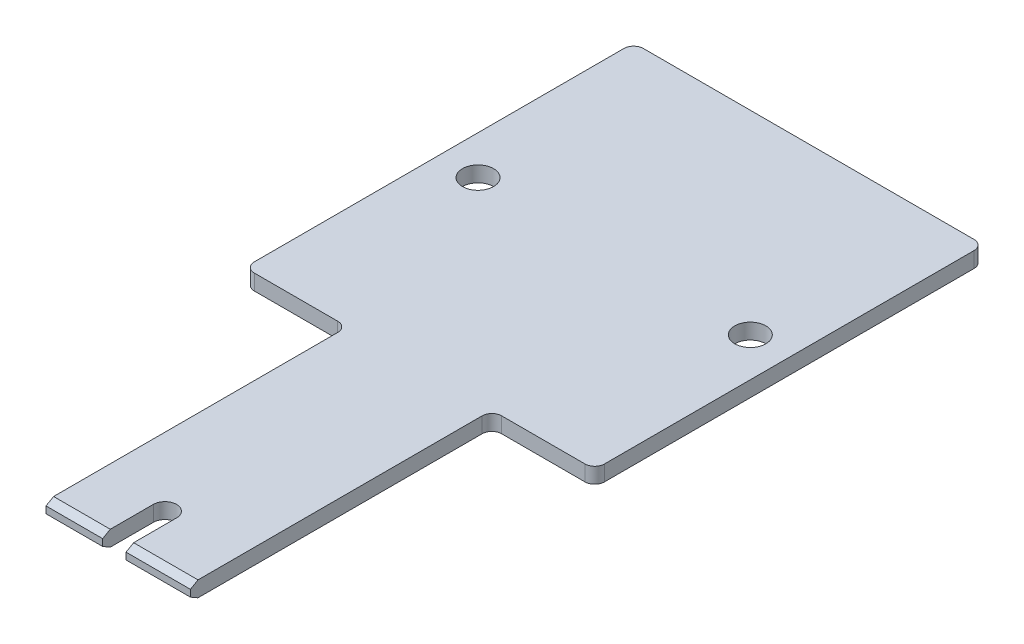
ISO-10303-21;
HEADER;
FILE_DESCRIPTION(('STEP AP214'),'2;1');
FILE_NAME('part.step','',(''),(''),'','','');
FILE_SCHEMA(('AUTOMOTIVE_DESIGN { 1 0 10303 214 1 1 1 1 }'));
ENDSEC;
DATA;
#1=APPLICATION_CONTEXT('core data for automotive mechanical design processes');
#2=APPLICATION_PROTOCOL_DEFINITION('international standard','automotive_design',2000,#1);
#3=PRODUCT_CONTEXT('',#1,'mechanical');
#4=PRODUCT('Part','Part','',(#3));
#5=PRODUCT_RELATED_PRODUCT_CATEGORY('part','',(#4));
#6=PRODUCT_DEFINITION_FORMATION('','',#4);
#7=PRODUCT_DEFINITION_CONTEXT('part definition',#1,'design');
#8=PRODUCT_DEFINITION('design','',#6,#7);
#9=PRODUCT_DEFINITION_SHAPE('','',#8);
#10=(LENGTH_UNIT() NAMED_UNIT(*) SI_UNIT(.MILLI.,.METRE.));
#11=(NAMED_UNIT(*) PLANE_ANGLE_UNIT() SI_UNIT($,.RADIAN.));
#12=(NAMED_UNIT(*) SI_UNIT($,.STERADIAN.) SOLID_ANGLE_UNIT());
#13=UNCERTAINTY_MEASURE_WITH_UNIT(LENGTH_MEASURE(1.E-05),#10,'distance_accuracy_value','');
#14=(GEOMETRIC_REPRESENTATION_CONTEXT(3) GLOBAL_UNCERTAINTY_ASSIGNED_CONTEXT((#13)) GLOBAL_UNIT_ASSIGNED_CONTEXT((#10,
#11,#12)) REPRESENTATION_CONTEXT('',''));
#15=CARTESIAN_POINT('',(0.,0.,0.));
#16=DIRECTION('',(0.,0.,1.));
#17=DIRECTION('',(1.,0.,0.));
#18=AXIS2_PLACEMENT_3D('',#15,#16,#17);
#19=CARTESIAN_POINT('',(-7.425,1.6,15.5));
#20=DIRECTION('',(0.,0.,-1.));
#21=DIRECTION('',(-1.,0.,0.));
#22=AXIS2_PLACEMENT_3D('',#19,#20,#21);
#23=PLANE('',#22);
#24=DIRECTION('',(-1.,0.,0.));
#25=VECTOR('',#24,1.);
#26=CARTESIAN_POINT('',(-7.425,1.15,15.5));
#27=LINE('',#26,#25);
#28=CARTESIAN_POINT('',(7.425,1.15,15.5));
#29=VERTEX_POINT('',#28);
#30=CARTESIAN_POINT('',(0.804999999999998,1.15,15.5));
#31=VERTEX_POINT('',#30);
#32=EDGE_CURVE('E278',#29,#31,#27,.T.);
#33=ORIENTED_EDGE('',*,*,#32,.T.);
#34=DIRECTION('',(0.,1.,0.));
#35=VECTOR('',#34,1.);
#36=CARTESIAN_POINT('',(0.804999999999998,0.,15.5));
#37=LINE('',#36,#35);
#38=CARTESIAN_POINT('',(0.804999999999998,0.449999999999999,15.5));
#39=VERTEX_POINT('',#38);
#40=EDGE_CURVE('E222',#39,#31,#37,.T.);
#41=ORIENTED_EDGE('',*,*,#40,.F.);
#42=DIRECTION('',(1.,0.,0.));
#43=VECTOR('',#42,1.);
#44=CARTESIAN_POINT('',(-7.425,0.449999999999999,15.5));
#45=LINE('',#44,#43);
#46=CARTESIAN_POINT('',(7.425,0.449999999999999,15.5));
#47=VERTEX_POINT('',#46);
#48=EDGE_CURVE('E281',#39,#47,#45,.T.);
#49=ORIENTED_EDGE('',*,*,#48,.T.);
#50=DIRECTION('',(0.,-1.,0.));
#51=VECTOR('',#50,1.);
#52=CARTESIAN_POINT('',(7.425,1.6,15.5));
#53=LINE('',#52,#51);
#54=EDGE_CURVE('E253',#29,#47,#53,.T.);
#55=ORIENTED_EDGE('',*,*,#54,.F.);
#56=EDGE_LOOP('',(#33,#41,#49,#55));
#57=FACE_BOUND('',#56,.T.);
#58=ADVANCED_FACE('F37',(#57),#23,.F.);
#59=CARTESIAN_POINT('',(-7.425,0.449999999999999,15.5));
#60=DIRECTION('',(0.,0.866025403784441,-0.499999999999996));
#61=DIRECTION('',(1.,0.,0.));
#62=AXIS2_PLACEMENT_3D('',#59,#60,#61);
#63=PLANE('',#62);
#64=DIRECTION('',(0.,-0.499999999999996,-0.866025403784441));
#65=VECTOR('',#64,1.);
#66=CARTESIAN_POINT('',(0.804999999999998,0.449999999999998,15.5));
#67=LINE('',#66,#65);
#68=CARTESIAN_POINT('',(0.804999999999998,0.,14.720577136594));
#69=VERTEX_POINT('',#68);
#70=EDGE_CURVE('E230',#69,#39,#67,.F.);
#71=ORIENTED_EDGE('',*,*,#70,.F.);
#72=DIRECTION('',(-1.,0.,0.));
#73=VECTOR('',#72,1.);
#74=CARTESIAN_POINT('',(0.,0.,14.720577136594));
#75=LINE('',#74,#73);
#76=CARTESIAN_POINT('',(7.425,0.,14.720577136594));
#77=VERTEX_POINT('',#76);
#78=EDGE_CURVE('E211',#77,#69,#75,.T.);
#79=ORIENTED_EDGE('',*,*,#78,.F.);
#80=DIRECTION('',(0.,0.499999999999996,0.866025403784441));
#81=VECTOR('',#80,1.);
#82=CARTESIAN_POINT('',(7.425,0.449999999999998,15.5));
#83=LINE('',#82,#81);
#84=EDGE_CURVE('E287',#47,#77,#83,.F.);
#85=ORIENTED_EDGE('',*,*,#84,.F.);
#86=ORIENTED_EDGE('',*,*,#48,.F.);
#87=EDGE_LOOP('',(#71,#79,#85,#86));
#88=FACE_BOUND('',#87,.T.);
#89=ADVANCED_FACE('F424',(#88),#63,.F.);
#90=CARTESIAN_POINT('',(0.,1.6,14.720577136594));
#91=DIRECTION('',(0.,0.866025403784441,0.499999999999996));
#92=DIRECTION('',(-1.,0.,0.));
#93=AXIS2_PLACEMENT_3D('',#90,#91,#92);
#94=PLANE('',#93);
#95=DIRECTION('',(0.,0.499999999999996,-0.866025403784441));
#96=VECTOR('',#95,1.);
#97=CARTESIAN_POINT('',(0.804999999999998,1.6,14.720577136594));
#98=LINE('',#97,#96);
#99=CARTESIAN_POINT('',(0.804999999999998,1.6,14.720577136594));
#100=VERTEX_POINT('',#99);
#101=EDGE_CURVE('E11',#31,#100,#98,.T.);
#102=ORIENTED_EDGE('',*,*,#101,.F.);
#103=ORIENTED_EDGE('',*,*,#32,.F.);
#104=DIRECTION('',(0.,-0.499999999999996,0.866025403784441));
#105=VECTOR('',#104,1.);
#106=CARTESIAN_POINT('',(7.425,1.6,14.720577136594));
#107=LINE('',#106,#105);
#108=CARTESIAN_POINT('',(7.425,1.6,14.720577136594));
#109=VERTEX_POINT('',#108);
#110=EDGE_CURVE('E285',#109,#29,#107,.T.);
#111=ORIENTED_EDGE('',*,*,#110,.F.);
#112=DIRECTION('',(1.,0.,0.));
#113=VECTOR('',#112,1.);
#114=CARTESIAN_POINT('',(7.425,1.6,14.720577136594));
#115=LINE('',#114,#113);
#116=EDGE_CURVE('E296',#100,#109,#115,.T.);
#117=ORIENTED_EDGE('',*,*,#116,.F.);
#118=EDGE_LOOP('',(#102,#103,#111,#117));
#119=FACE_BOUND('',#118,.T.);
#120=ADVANCED_FACE('F431',(#119),#94,.T.);
#121=CARTESIAN_POINT('',(7.425,1.6,-15.5));
#122=DIRECTION('',(-1.,0.,0.));
#123=DIRECTION('',(0.,0.,1.));
#124=AXIS2_PLACEMENT_3D('',#121,#122,#123);
#125=PLANE('',#124);
#126=DIRECTION('',(0.,0.,-1.));
#127=VECTOR('',#126,1.);
#128=CARTESIAN_POINT('',(7.425,0.,-15.5));
#129=LINE('',#128,#127);
#130=CARTESIAN_POINT('',(7.425,0.,-14.5));
#131=VERTEX_POINT('',#130);
#132=EDGE_CURVE('E232',#77,#131,#129,.T.);
#133=ORIENTED_EDGE('',*,*,#132,.T.);
#134=DIRECTION('',(0.,-1.,0.));
#135=VECTOR('',#134,1.);
#136=CARTESIAN_POINT('',(7.425,1.6,-14.5));
#137=LINE('',#136,#135);
#138=CARTESIAN_POINT('',(7.425,1.6,-14.5));
#139=VERTEX_POINT('',#138);
#140=EDGE_CURVE('E305',#131,#139,#137,.F.);
#141=ORIENTED_EDGE('',*,*,#140,.T.);
#142=DIRECTION('',(0.,0.,-1.));
#143=VECTOR('',#142,1.);
#144=CARTESIAN_POINT('',(7.425,1.6,-15.5));
#145=LINE('',#144,#143);
#146=EDGE_CURVE('E233',#109,#139,#145,.T.);
#147=ORIENTED_EDGE('',*,*,#146,.F.);
#148=ORIENTED_EDGE('',*,*,#110,.T.);
#149=ORIENTED_EDGE('',*,*,#54,.T.);
#150=ORIENTED_EDGE('',*,*,#84,.T.);
#151=EDGE_LOOP('',(#133,#141,#147,#148,#149,#150));
#152=FACE_BOUND('',#151,.T.);
#153=ADVANCED_FACE('F418',(#152),#125,.F.);
#154=CARTESIAN_POINT('',(18.,1.6,-15.5));
#155=DIRECTION('',(0.,0.,-1.));
#156=DIRECTION('',(-1.,0.,0.));
#157=AXIS2_PLACEMENT_3D('',#154,#155,#156);
#158=PLANE('',#157);
#159=DIRECTION('',(1.,0.,0.));
#160=VECTOR('',#159,1.);
#161=CARTESIAN_POINT('',(18.,1.6,-15.5));
#162=LINE('',#161,#160);
#163=CARTESIAN_POINT('',(8.425,1.6,-15.5));
#164=VERTEX_POINT('',#163);
#165=CARTESIAN_POINT('',(17.,1.6,-15.5));
#166=VERTEX_POINT('',#165);
#167=EDGE_CURVE('E236',#164,#166,#162,.T.);
#168=ORIENTED_EDGE('',*,*,#167,.F.);
#169=DIRECTION('',(0.,-1.,0.));
#170=VECTOR('',#169,1.);
#171=CARTESIAN_POINT('',(8.425,0.,-15.5));
#172=LINE('',#171,#170);
#173=CARTESIAN_POINT('',(8.425,0.,-15.5));
#174=VERTEX_POINT('',#173);
#175=EDGE_CURVE('E302',#164,#174,#172,.T.);
#176=ORIENTED_EDGE('',*,*,#175,.T.);
#177=DIRECTION('',(1.,0.,0.));
#178=VECTOR('',#177,1.);
#179=CARTESIAN_POINT('',(18.,0.,-15.5));
#180=LINE('',#179,#178);
#181=CARTESIAN_POINT('',(17.,0.,-15.5));
#182=VERTEX_POINT('',#181);
#183=EDGE_CURVE('E256',#174,#182,#180,.T.);
#184=ORIENTED_EDGE('',*,*,#183,.T.);
#185=DIRECTION('',(0.,-1.,0.));
#186=VECTOR('',#185,1.);
#187=CARTESIAN_POINT('',(17.,1.6,-15.5));
#188=LINE('',#187,#186);
#189=EDGE_CURVE('E300',#182,#166,#188,.F.);
#190=ORIENTED_EDGE('',*,*,#189,.T.);
#191=EDGE_LOOP('',(#168,#176,#184,#190));
#192=FACE_BOUND('',#191,.T.);
#193=ADVANCED_FACE('F411',(#192),#158,.F.);
#194=CARTESIAN_POINT('',(18.,1.6,-55.5));
#195=DIRECTION('',(-1.,0.,0.));
#196=DIRECTION('',(0.,0.,1.));
#197=AXIS2_PLACEMENT_3D('',#194,#195,#196);
#198=PLANE('',#197);
#199=DIRECTION('',(0.,0.,-1.));
#200=VECTOR('',#199,1.);
#201=CARTESIAN_POINT('',(18.,1.6,-55.5));
#202=LINE('',#201,#200);
#203=CARTESIAN_POINT('',(18.,1.6,-16.5));
#204=VERTEX_POINT('',#203);
#205=CARTESIAN_POINT('',(18.,1.6,-54.5));
#206=VERTEX_POINT('',#205);
#207=EDGE_CURVE('E240',#204,#206,#202,.T.);
#208=ORIENTED_EDGE('',*,*,#207,.F.);
#209=DIRECTION('',(0.,-1.,0.));
#210=VECTOR('',#209,1.);
#211=CARTESIAN_POINT('',(18.,1.6,-16.5));
#212=LINE('',#211,#210);
#213=CARTESIAN_POINT('',(18.,0.,-16.5));
#214=VERTEX_POINT('',#213);
#215=EDGE_CURVE('E309',#204,#214,#212,.T.);
#216=ORIENTED_EDGE('',*,*,#215,.T.);
#217=DIRECTION('',(0.,0.,-1.));
#218=VECTOR('',#217,1.);
#219=CARTESIAN_POINT('',(18.,0.,-55.5));
#220=LINE('',#219,#218);
#221=CARTESIAN_POINT('',(18.,0.,-54.5));
#222=VERTEX_POINT('',#221);
#223=EDGE_CURVE('E259',#214,#222,#220,.T.);
#224=ORIENTED_EDGE('',*,*,#223,.T.);
#225=DIRECTION('',(0.,-1.,0.));
#226=VECTOR('',#225,1.);
#227=CARTESIAN_POINT('',(18.,1.6,-54.5));
#228=LINE('',#227,#226);
#229=EDGE_CURVE('E307',#222,#206,#228,.F.);
#230=ORIENTED_EDGE('',*,*,#229,.T.);
#231=EDGE_LOOP('',(#208,#216,#224,#230));
#232=FACE_BOUND('',#231,.T.);
#233=ADVANCED_FACE('F402',(#232),#198,.F.);
#234=CARTESIAN_POINT('',(-18.,1.6,-55.5));
#235=DIRECTION('',(0.,0.,1.));
#236=DIRECTION('',(1.,0.,0.));
#237=AXIS2_PLACEMENT_3D('',#234,#235,#236);
#238=PLANE('',#237);
#239=DIRECTION('',(-1.,0.,0.));
#240=VECTOR('',#239,1.);
#241=CARTESIAN_POINT('',(-18.,1.6,-55.5));
#242=LINE('',#241,#240);
#243=CARTESIAN_POINT('',(17.,1.6,-55.5));
#244=VERTEX_POINT('',#243);
#245=CARTESIAN_POINT('',(-17.,1.6,-55.5));
#246=VERTEX_POINT('',#245);
#247=EDGE_CURVE('E243',#244,#246,#242,.T.);
#248=ORIENTED_EDGE('',*,*,#247,.F.);
#249=DIRECTION('',(0.,-1.,0.));
#250=VECTOR('',#249,1.);
#251=CARTESIAN_POINT('',(17.,1.6,-55.5));
#252=LINE('',#251,#250);
#253=CARTESIAN_POINT('',(17.,0.,-55.5));
#254=VERTEX_POINT('',#253);
#255=EDGE_CURVE('E330',#244,#254,#252,.T.);
#256=ORIENTED_EDGE('',*,*,#255,.T.);
#257=DIRECTION('',(-1.,0.,0.));
#258=VECTOR('',#257,1.);
#259=CARTESIAN_POINT('',(-18.,0.,-55.5));
#260=LINE('',#259,#258);
#261=CARTESIAN_POINT('',(-17.,0.,-55.5));
#262=VERTEX_POINT('',#261);
#263=EDGE_CURVE('E262',#254,#262,#260,.T.);
#264=ORIENTED_EDGE('',*,*,#263,.T.);
#265=DIRECTION('',(0.,-1.,0.));
#266=VECTOR('',#265,1.);
#267=CARTESIAN_POINT('',(-17.,1.6,-55.5));
#268=LINE('',#267,#266);
#269=EDGE_CURVE('E328',#262,#246,#268,.F.);
#270=ORIENTED_EDGE('',*,*,#269,.T.);
#271=EDGE_LOOP('',(#248,#256,#264,#270));
#272=FACE_BOUND('',#271,.T.);
#273=ADVANCED_FACE('F393',(#272),#238,.F.);
#274=CARTESIAN_POINT('',(-18.,1.6,-15.5));
#275=DIRECTION('',(1.,0.,0.));
#276=DIRECTION('',(0.,0.,-1.));
#277=AXIS2_PLACEMENT_3D('',#274,#275,#276);
#278=PLANE('',#277);
#279=DIRECTION('',(0.,0.,1.));
#280=VECTOR('',#279,1.);
#281=CARTESIAN_POINT('',(-18.,1.6,-15.5));
#282=LINE('',#281,#280);
#283=CARTESIAN_POINT('',(-18.,1.6,-54.5));
#284=VERTEX_POINT('',#283);
#285=CARTESIAN_POINT('',(-18.,1.6,-16.5));
#286=VERTEX_POINT('',#285);
#287=EDGE_CURVE('E246',#284,#286,#282,.T.);
#288=ORIENTED_EDGE('',*,*,#287,.F.);
#289=DIRECTION('',(0.,-1.,0.));
#290=VECTOR('',#289,1.);
#291=CARTESIAN_POINT('',(-18.,1.6,-54.5));
#292=LINE('',#291,#290);
#293=CARTESIAN_POINT('',(-18.,0.,-54.5));
#294=VERTEX_POINT('',#293);
#295=EDGE_CURVE('E335',#284,#294,#292,.T.);
#296=ORIENTED_EDGE('',*,*,#295,.T.);
#297=DIRECTION('',(0.,0.,1.));
#298=VECTOR('',#297,1.);
#299=CARTESIAN_POINT('',(-18.,0.,-15.5));
#300=LINE('',#299,#298);
#301=CARTESIAN_POINT('',(-18.,0.,-16.5));
#302=VERTEX_POINT('',#301);
#303=EDGE_CURVE('E265',#294,#302,#300,.T.);
#304=ORIENTED_EDGE('',*,*,#303,.T.);
#305=DIRECTION('',(0.,-1.,0.));
#306=VECTOR('',#305,1.);
#307=CARTESIAN_POINT('',(-18.,1.6,-16.5));
#308=LINE('',#307,#306);
#309=EDGE_CURVE('E333',#302,#286,#308,.F.);
#310=ORIENTED_EDGE('',*,*,#309,.T.);
#311=EDGE_LOOP('',(#288,#296,#304,#310));
#312=FACE_BOUND('',#311,.T.);
#313=ADVANCED_FACE('F384',(#312),#278,.F.);
#314=CARTESIAN_POINT('',(-7.425,1.6,-15.5));
#315=DIRECTION('',(0.,0.,-1.));
#316=DIRECTION('',(-1.,0.,0.));
#317=AXIS2_PLACEMENT_3D('',#314,#315,#316);
#318=PLANE('',#317);
#319=DIRECTION('',(1.,0.,0.));
#320=VECTOR('',#319,1.);
#321=CARTESIAN_POINT('',(-7.425,1.6,-15.5));
#322=LINE('',#321,#320);
#323=CARTESIAN_POINT('',(-17.,1.6,-15.5));
#324=VERTEX_POINT('',#323);
#325=CARTESIAN_POINT('',(-8.42500000000001,1.6,-15.5));
#326=VERTEX_POINT('',#325);
#327=EDGE_CURVE('E249',#324,#326,#322,.T.);
#328=ORIENTED_EDGE('',*,*,#327,.F.);
#329=DIRECTION('',(0.,-1.,0.));
#330=VECTOR('',#329,1.);
#331=CARTESIAN_POINT('',(-17.,1.6,-15.5));
#332=LINE('',#331,#330);
#333=CARTESIAN_POINT('',(-17.,0.,-15.5));
#334=VERTEX_POINT('',#333);
#335=EDGE_CURVE('E339',#324,#334,#332,.T.);
#336=ORIENTED_EDGE('',*,*,#335,.T.);
#337=DIRECTION('',(1.,0.,0.));
#338=VECTOR('',#337,1.);
#339=CARTESIAN_POINT('',(-7.425,0.,-15.5));
#340=LINE('',#339,#338);
#341=CARTESIAN_POINT('',(-8.42500000000001,0.,-15.5));
#342=VERTEX_POINT('',#341);
#343=EDGE_CURVE('E268',#334,#342,#340,.T.);
#344=ORIENTED_EDGE('',*,*,#343,.T.);
#345=DIRECTION('',(0.,-1.,0.));
#346=VECTOR('',#345,1.);
#347=CARTESIAN_POINT('',(-8.42500000000001,1.6,-15.5));
#348=LINE('',#347,#346);
#349=EDGE_CURVE('E60',#342,#326,#348,.F.);
#350=ORIENTED_EDGE('',*,*,#349,.T.);
#351=EDGE_LOOP('',(#328,#336,#344,#350));
#352=FACE_BOUND('',#351,.T.);
#353=ADVANCED_FACE('F375',(#352),#318,.F.);
#354=CARTESIAN_POINT('',(-7.425,1.6,-15.5));
#355=DIRECTION('',(1.,0.,0.));
#356=DIRECTION('',(0.,0.,-1.));
#357=AXIS2_PLACEMENT_3D('',#354,#355,#356);
#358=PLANE('',#357);
#359=DIRECTION('',(0.,0.,1.));
#360=VECTOR('',#359,1.);
#361=CARTESIAN_POINT('',(-7.425,1.6,-15.5));
#362=LINE('',#361,#360);
#363=CARTESIAN_POINT('',(-7.425,1.6,-14.5));
#364=VERTEX_POINT('',#363);
#365=CARTESIAN_POINT('',(-7.425,1.6,14.720577136594));
#366=VERTEX_POINT('',#365);
#367=EDGE_CURVE('E251',#364,#366,#362,.T.);
#368=ORIENTED_EDGE('',*,*,#367,.F.);
#369=DIRECTION('',(0.,-1.,0.));
#370=VECTOR('',#369,1.);
#371=CARTESIAN_POINT('',(-7.425,0.,-14.5));
#372=LINE('',#371,#370);
#373=CARTESIAN_POINT('',(-7.425,0.,-14.5));
#374=VERTEX_POINT('',#373);
#375=EDGE_CURVE('E342',#364,#374,#372,.T.);
#376=ORIENTED_EDGE('',*,*,#375,.T.);
#377=DIRECTION('',(0.,0.,1.));
#378=VECTOR('',#377,1.);
#379=CARTESIAN_POINT('',(-7.425,0.,-15.5));
#380=LINE('',#379,#378);
#381=CARTESIAN_POINT('',(-7.425,0.,14.720577136594));
#382=VERTEX_POINT('',#381);
#383=EDGE_CURVE('E237',#374,#382,#380,.T.);
#384=ORIENTED_EDGE('',*,*,#383,.T.);
#385=DIRECTION('',(0.,-0.499999999999996,-0.866025403784441));
#386=VECTOR('',#385,1.);
#387=CARTESIAN_POINT('',(-7.425,0.449999999999999,15.5));
#388=LINE('',#387,#386);
#389=CARTESIAN_POINT('',(-7.425,0.449999999999999,15.5));
#390=VERTEX_POINT('',#389);
#391=EDGE_CURVE('E294',#382,#390,#388,.F.);
#392=ORIENTED_EDGE('',*,*,#391,.T.);
#393=DIRECTION('',(0.,-1.,0.));
#394=VECTOR('',#393,1.);
#395=CARTESIAN_POINT('',(-7.425,1.6,15.5));
#396=LINE('',#395,#394);
#397=CARTESIAN_POINT('',(-7.425,1.15,15.5));
#398=VERTEX_POINT('',#397);
#399=EDGE_CURVE('E274',#398,#390,#396,.T.);
#400=ORIENTED_EDGE('',*,*,#399,.F.);
#401=DIRECTION('',(0.,0.499999999999996,-0.866025403784441));
#402=VECTOR('',#401,1.);
#403=CARTESIAN_POINT('',(-7.425,1.6,14.720577136594));
#404=LINE('',#403,#402);
#405=EDGE_CURVE('E291',#398,#366,#404,.T.);
#406=ORIENTED_EDGE('',*,*,#405,.T.);
#407=EDGE_LOOP('',(#368,#376,#384,#392,#400,#406));
#408=FACE_BOUND('',#407,.T.);
#409=ADVANCED_FACE('F365',(#408),#358,.F.);
#410=CARTESIAN_POINT('',(-1.595,0.449999999999999,15.5));
#411=VERTEX_POINT('',#410);
#412=EDGE_CURVE('E282',#390,#411,#45,.T.);
#413=ORIENTED_EDGE('',*,*,#412,.T.);
#414=DIRECTION('',(0.,1.,0.));
#415=VECTOR('',#414,1.);
#416=CARTESIAN_POINT('',(-1.595,0.,15.5));
#417=LINE('',#416,#415);
#418=CARTESIAN_POINT('',(-1.595,1.15,15.5));
#419=VERTEX_POINT('',#418);
#420=EDGE_CURVE('E225',#411,#419,#417,.T.);
#421=ORIENTED_EDGE('',*,*,#420,.T.);
#422=EDGE_CURVE('E277',#419,#398,#27,.T.);
#423=ORIENTED_EDGE('',*,*,#422,.T.);
#424=ORIENTED_EDGE('',*,*,#399,.T.);
#425=EDGE_LOOP('',(#413,#421,#423,#424));
#426=FACE_BOUND('',#425,.T.);
#427=ADVANCED_FACE('F358',(#426),#23,.F.);
#428=CARTESIAN_POINT('',(0.,1.6,0.));
#429=DIRECTION('',(0.,1.,0.));
#430=DIRECTION('',(0.,0.,1.));
#431=AXIS2_PLACEMENT_3D('',#428,#429,#430);
#432=PLANE('',#431);
#433=CARTESIAN_POINT('',(-14.,1.6,-35.5));
#434=DIRECTION('',(0.,1.,0.));
#435=DIRECTION('',(0.,0.,1.));
#436=AXIS2_PLACEMENT_3D('',#433,#434,#435);
#437=CIRCLE('',#436,1.59999999999999);
#438=CARTESIAN_POINT('',(-14.,1.6,-33.9));
#439=VERTEX_POINT('',#438);
#440=EDGE_CURVE('E506',#439,#439,#437,.T.);
#441=ORIENTED_EDGE('',*,*,#440,.F.);
#442=EDGE_LOOP('',(#441));
#443=FACE_BOUND('',#442,.T.);
#444=CARTESIAN_POINT('',(14.,1.6,-35.5));
#445=DIRECTION('',(0.,1.,0.));
#446=DIRECTION('',(0.,0.,1.));
#447=AXIS2_PLACEMENT_3D('',#444,#445,#446);
#448=CIRCLE('',#447,1.59999999999999);
#449=CARTESIAN_POINT('',(14.,1.6,-33.9));
#450=VERTEX_POINT('',#449);
#451=EDGE_CURVE('E508',#450,#450,#448,.T.);
#452=ORIENTED_EDGE('',*,*,#451,.F.);
#453=EDGE_LOOP('',(#452));
#454=FACE_BOUND('',#453,.T.);
#455=DIRECTION('',(0.,0.,-1.));
#456=VECTOR('',#455,1.);
#457=CARTESIAN_POINT('',(0.804999999999997,1.6,10.3));
#458=LINE('',#457,#456);
#459=CARTESIAN_POINT('',(0.804999999999997,1.6,10.3));
#460=VERTEX_POINT('',#459);
#461=EDGE_CURVE('E193',#100,#460,#458,.T.);
#462=ORIENTED_EDGE('',*,*,#461,.F.);
#463=ORIENTED_EDGE('',*,*,#116,.T.);
#464=ORIENTED_EDGE('',*,*,#146,.T.);
#465=CARTESIAN_POINT('',(8.425,1.6,-14.5));
#466=DIRECTION('',(0.,1.,0.));
#467=DIRECTION('',(0.,0.,1.));
#468=AXIS2_PLACEMENT_3D('',#465,#466,#467);
#469=CIRCLE('',#468,1.);
#470=EDGE_CURVE('E347',#139,#164,#469,.F.);
#471=ORIENTED_EDGE('',*,*,#470,.T.);
#472=ORIENTED_EDGE('',*,*,#167,.T.);
#473=CARTESIAN_POINT('',(17.,1.6,-16.5));
#474=DIRECTION('',(0.,1.,0.));
#475=DIRECTION('',(0.,0.,1.));
#476=AXIS2_PLACEMENT_3D('',#473,#474,#475);
#477=CIRCLE('',#476,1.);
#478=EDGE_CURVE('E326',#166,#204,#477,.T.);
#479=ORIENTED_EDGE('',*,*,#478,.T.);
#480=ORIENTED_EDGE('',*,*,#207,.T.);
#481=CARTESIAN_POINT('',(17.,1.6,-54.5));
#482=DIRECTION('',(0.,1.,0.));
#483=DIRECTION('',(0.,0.,1.));
#484=AXIS2_PLACEMENT_3D('',#481,#482,#483);
#485=CIRCLE('',#484,1.);
#486=EDGE_CURVE('E324',#206,#244,#485,.T.);
#487=ORIENTED_EDGE('',*,*,#486,.T.);
#488=ORIENTED_EDGE('',*,*,#247,.T.);
#489=CARTESIAN_POINT('',(-17.,1.6,-54.5));
#490=DIRECTION('',(0.,1.,0.));
#491=DIRECTION('',(0.,0.,1.));
#492=AXIS2_PLACEMENT_3D('',#489,#490,#491);
#493=CIRCLE('',#492,1.);
#494=EDGE_CURVE('E322',#246,#284,#493,.T.);
#495=ORIENTED_EDGE('',*,*,#494,.T.);
#496=ORIENTED_EDGE('',*,*,#287,.T.);
#497=CARTESIAN_POINT('',(-17.,1.6,-16.5));
#498=DIRECTION('',(0.,1.,0.));
#499=DIRECTION('',(0.,0.,1.));
#500=AXIS2_PLACEMENT_3D('',#497,#498,#499);
#501=CIRCLE('',#500,1.);
#502=EDGE_CURVE('E320',#286,#324,#501,.T.);
#503=ORIENTED_EDGE('',*,*,#502,.T.);
#504=ORIENTED_EDGE('',*,*,#327,.T.);
#505=CARTESIAN_POINT('',(-8.42500000000001,1.6,-14.5));
#506=DIRECTION('',(0.,1.,0.));
#507=DIRECTION('',(0.,0.,1.));
#508=AXIS2_PLACEMENT_3D('',#505,#506,#507);
#509=CIRCLE('',#508,1.);
#510=EDGE_CURVE('E351',#326,#364,#509,.F.);
#511=ORIENTED_EDGE('',*,*,#510,.T.);
#512=ORIENTED_EDGE('',*,*,#367,.T.);
#513=CARTESIAN_POINT('',(-1.595,1.6,14.720577136594));
#514=VERTEX_POINT('',#513);
#515=EDGE_CURVE('E297',#366,#514,#115,.T.);
#516=ORIENTED_EDGE('',*,*,#515,.T.);
#517=DIRECTION('',(0.,0.,1.));
#518=VECTOR('',#517,1.);
#519=CARTESIAN_POINT('',(-1.595,1.6,10.3));
#520=LINE('',#519,#518);
#521=CARTESIAN_POINT('',(-1.595,1.6,10.3));
#522=VERTEX_POINT('',#521);
#523=EDGE_CURVE('E52',#522,#514,#520,.T.);
#524=ORIENTED_EDGE('',*,*,#523,.F.);
#525=CARTESIAN_POINT('',(-0.395000000000003,1.6,10.3));
#526=DIRECTION('',(0.,1.,0.));
#527=DIRECTION('',(0.,0.,1.));
#528=AXIS2_PLACEMENT_3D('',#525,#526,#527);
#529=CIRCLE('',#528,1.2);
#530=EDGE_CURVE('E213',#460,#522,#529,.T.);
#531=ORIENTED_EDGE('',*,*,#530,.F.);
#532=EDGE_LOOP('',(#462,#463,#464,#471,#472,#479,#480,#487,#488,#495,#496,#503,#504,#511,#512,
#516,#524,#531));
#533=FACE_BOUND('',#532,.T.);
#534=ADVANCED_FACE('F434',(#443,#454,#533),#432,.T.);
#535=CARTESIAN_POINT('',(0.,0.,0.));
#536=DIRECTION('',(0.,1.,0.));
#537=DIRECTION('',(0.,0.,1.));
#538=AXIS2_PLACEMENT_3D('',#535,#536,#537);
#539=PLANE('',#538);
#540=CARTESIAN_POINT('',(-14.,0.,-35.5));
#541=DIRECTION('',(0.,1.,0.));
#542=DIRECTION('',(0.,0.,1.));
#543=AXIS2_PLACEMENT_3D('',#540,#541,#542);
#544=CIRCLE('',#543,1.59999999999999);
#545=CARTESIAN_POINT('',(-14.,0.,-33.9));
#546=VERTEX_POINT('',#545);
#547=EDGE_CURVE('E504',#546,#546,#544,.T.);
#548=ORIENTED_EDGE('',*,*,#547,.T.);
#549=EDGE_LOOP('',(#548));
#550=FACE_BOUND('',#549,.T.);
#551=CARTESIAN_POINT('',(14.,0.,-35.5));
#552=DIRECTION('',(0.,1.,0.));
#553=DIRECTION('',(0.,0.,1.));
#554=AXIS2_PLACEMENT_3D('',#551,#552,#553);
#555=CIRCLE('',#554,1.59999999999999);
#556=CARTESIAN_POINT('',(14.,0.,-33.9));
#557=VERTEX_POINT('',#556);
#558=EDGE_CURVE('E216',#557,#557,#555,.T.);
#559=ORIENTED_EDGE('',*,*,#558,.T.);
#560=EDGE_LOOP('',(#559));
#561=FACE_BOUND('',#560,.T.);
#562=ORIENTED_EDGE('',*,*,#78,.T.);
#563=DIRECTION('',(0.,0.,-1.));
#564=VECTOR('',#563,1.);
#565=CARTESIAN_POINT('',(0.804999999999997,0.,10.3));
#566=LINE('',#565,#564);
#567=CARTESIAN_POINT('',(0.804999999999997,0.,10.3));
#568=VERTEX_POINT('',#567);
#569=EDGE_CURVE('E190',#69,#568,#566,.T.);
#570=ORIENTED_EDGE('',*,*,#569,.T.);
#571=CARTESIAN_POINT('',(-0.395000000000003,0.,10.3));
#572=DIRECTION('',(0.,1.,0.));
#573=DIRECTION('',(0.,0.,1.));
#574=AXIS2_PLACEMENT_3D('',#571,#572,#573);
#575=CIRCLE('',#574,1.2);
#576=CARTESIAN_POINT('',(-1.595,0.,10.3));
#577=VERTEX_POINT('',#576);
#578=EDGE_CURVE('E201',#568,#577,#575,.T.);
#579=ORIENTED_EDGE('',*,*,#578,.T.);
#580=DIRECTION('',(0.,0.,1.));
#581=VECTOR('',#580,1.);
#582=CARTESIAN_POINT('',(-1.595,0.,10.3));
#583=LINE('',#582,#581);
#584=CARTESIAN_POINT('',(-1.595,0.,14.720577136594));
#585=VERTEX_POINT('',#584);
#586=EDGE_CURVE('E198',#577,#585,#583,.T.);
#587=ORIENTED_EDGE('',*,*,#586,.T.);
#588=EDGE_CURVE('E289',#585,#382,#75,.T.);
#589=ORIENTED_EDGE('',*,*,#588,.T.);
#590=ORIENTED_EDGE('',*,*,#383,.F.);
#591=CARTESIAN_POINT('',(-8.42500000000001,0.,-14.5));
#592=DIRECTION('',(0.,1.,0.));
#593=DIRECTION('',(0.,0.,1.));
#594=AXIS2_PLACEMENT_3D('',#591,#592,#593);
#595=CIRCLE('',#594,1.);
#596=EDGE_CURVE('E349',#374,#342,#595,.T.);
#597=ORIENTED_EDGE('',*,*,#596,.T.);
#598=ORIENTED_EDGE('',*,*,#343,.F.);
#599=CARTESIAN_POINT('',(-17.,0.,-16.5));
#600=DIRECTION('',(0.,1.,0.));
#601=DIRECTION('',(0.,0.,1.));
#602=AXIS2_PLACEMENT_3D('',#599,#600,#601);
#603=CIRCLE('',#602,1.);
#604=EDGE_CURVE('E312',#334,#302,#603,.F.);
#605=ORIENTED_EDGE('',*,*,#604,.T.);
#606=ORIENTED_EDGE('',*,*,#303,.F.);
#607=CARTESIAN_POINT('',(-17.,0.,-54.5));
#608=DIRECTION('',(0.,1.,0.));
#609=DIRECTION('',(0.,0.,1.));
#610=AXIS2_PLACEMENT_3D('',#607,#608,#609);
#611=CIRCLE('',#610,1.);
#612=EDGE_CURVE('E314',#294,#262,#611,.F.);
#613=ORIENTED_EDGE('',*,*,#612,.T.);
#614=ORIENTED_EDGE('',*,*,#263,.F.);
#615=CARTESIAN_POINT('',(17.,0.,-54.5));
#616=DIRECTION('',(0.,1.,0.));
#617=DIRECTION('',(0.,0.,1.));
#618=AXIS2_PLACEMENT_3D('',#615,#616,#617);
#619=CIRCLE('',#618,1.);
#620=EDGE_CURVE('E316',#254,#222,#619,.F.);
#621=ORIENTED_EDGE('',*,*,#620,.T.);
#622=ORIENTED_EDGE('',*,*,#223,.F.);
#623=CARTESIAN_POINT('',(17.,0.,-16.5));
#624=DIRECTION('',(0.,1.,0.));
#625=DIRECTION('',(0.,0.,1.));
#626=AXIS2_PLACEMENT_3D('',#623,#624,#625);
#627=CIRCLE('',#626,1.);
#628=EDGE_CURVE('E318',#214,#182,#627,.F.);
#629=ORIENTED_EDGE('',*,*,#628,.T.);
#630=ORIENTED_EDGE('',*,*,#183,.F.);
#631=CARTESIAN_POINT('',(8.425,0.,-14.5));
#632=DIRECTION('',(0.,1.,0.));
#633=DIRECTION('',(0.,0.,1.));
#634=AXIS2_PLACEMENT_3D('',#631,#632,#633);
#635=CIRCLE('',#634,1.);
#636=EDGE_CURVE('E345',#174,#131,#635,.T.);
#637=ORIENTED_EDGE('',*,*,#636,.T.);
#638=ORIENTED_EDGE('',*,*,#132,.F.);
#639=EDGE_LOOP('',(#562,#570,#579,#587,#589,#590,#597,#598,#605,#606,#613,#614,#621,#622,#629,
#630,#637,#638));
#640=FACE_BOUND('',#639,.T.);
#641=ADVANCED_FACE('F208',(#550,#561,#640),#539,.F.);
#642=DIRECTION('',(0.,0.499999999999996,0.866025403784441));
#643=VECTOR('',#642,1.);
#644=CARTESIAN_POINT('',(-1.595,0.449999999999999,15.5));
#645=LINE('',#644,#643);
#646=EDGE_CURVE('E224',#411,#585,#645,.F.);
#647=ORIENTED_EDGE('',*,*,#646,.F.);
#648=ORIENTED_EDGE('',*,*,#412,.F.);
#649=ORIENTED_EDGE('',*,*,#391,.F.);
#650=ORIENTED_EDGE('',*,*,#588,.F.);
#651=EDGE_LOOP('',(#647,#648,#649,#650));
#652=FACE_BOUND('',#651,.T.);
#653=ADVANCED_FACE('F369',(#652),#63,.F.);
#654=DIRECTION('',(0.,-0.499999999999996,0.866025403784441));
#655=VECTOR('',#654,1.);
#656=CARTESIAN_POINT('',(-1.595,1.6,14.720577136594));
#657=LINE('',#656,#655);
#658=EDGE_CURVE('E45',#514,#419,#657,.T.);
#659=ORIENTED_EDGE('',*,*,#658,.F.);
#660=ORIENTED_EDGE('',*,*,#515,.F.);
#661=ORIENTED_EDGE('',*,*,#405,.F.);
#662=ORIENTED_EDGE('',*,*,#422,.F.);
#663=EDGE_LOOP('',(#659,#660,#661,#662));
#664=FACE_BOUND('',#663,.T.);
#665=ADVANCED_FACE('F362',(#664),#94,.T.);
#666=CARTESIAN_POINT('',(8.425,1.6,-14.5));
#667=DIRECTION('',(0.,1.,0.));
#668=DIRECTION('',(0.,0.,1.));
#669=AXIS2_PLACEMENT_3D('',#666,#667,#668);
#670=CYLINDRICAL_SURFACE('',#669,1.);
#671=ORIENTED_EDGE('',*,*,#470,.F.);
#672=ORIENTED_EDGE('',*,*,#140,.F.);
#673=ORIENTED_EDGE('',*,*,#636,.F.);
#674=ORIENTED_EDGE('',*,*,#175,.F.);
#675=EDGE_LOOP('',(#671,#672,#673,#674));
#676=FACE_BOUND('',#675,.T.);
#677=ADVANCED_FACE('F415',(#676),#670,.F.);
#678=CARTESIAN_POINT('',(17.,1.6,-16.5));
#679=DIRECTION('',(0.,-1.,0.));
#680=DIRECTION('',(0.,0.,-1.));
#681=AXIS2_PLACEMENT_3D('',#678,#679,#680);
#682=CYLINDRICAL_SURFACE('',#681,1.);
#683=ORIENTED_EDGE('',*,*,#478,.F.);
#684=ORIENTED_EDGE('',*,*,#189,.F.);
#685=ORIENTED_EDGE('',*,*,#628,.F.);
#686=ORIENTED_EDGE('',*,*,#215,.F.);
#687=EDGE_LOOP('',(#683,#684,#685,#686));
#688=FACE_BOUND('',#687,.T.);
#689=ADVANCED_FACE('F406',(#688),#682,.T.);
#690=CARTESIAN_POINT('',(17.,1.6,-54.5));
#691=DIRECTION('',(0.,-1.,0.));
#692=DIRECTION('',(0.,0.,-1.));
#693=AXIS2_PLACEMENT_3D('',#690,#691,#692);
#694=CYLINDRICAL_SURFACE('',#693,1.);
#695=ORIENTED_EDGE('',*,*,#486,.F.);
#696=ORIENTED_EDGE('',*,*,#229,.F.);
#697=ORIENTED_EDGE('',*,*,#620,.F.);
#698=ORIENTED_EDGE('',*,*,#255,.F.);
#699=EDGE_LOOP('',(#695,#696,#697,#698));
#700=FACE_BOUND('',#699,.T.);
#701=ADVANCED_FACE('F397',(#700),#694,.T.);
#702=CARTESIAN_POINT('',(-17.,1.6,-54.5));
#703=DIRECTION('',(0.,-1.,0.));
#704=DIRECTION('',(0.,0.,-1.));
#705=AXIS2_PLACEMENT_3D('',#702,#703,#704);
#706=CYLINDRICAL_SURFACE('',#705,1.);
#707=ORIENTED_EDGE('',*,*,#494,.F.);
#708=ORIENTED_EDGE('',*,*,#269,.F.);
#709=ORIENTED_EDGE('',*,*,#612,.F.);
#710=ORIENTED_EDGE('',*,*,#295,.F.);
#711=EDGE_LOOP('',(#707,#708,#709,#710));
#712=FACE_BOUND('',#711,.T.);
#713=ADVANCED_FACE('F388',(#712),#706,.T.);
#714=CARTESIAN_POINT('',(-17.,1.6,-16.5));
#715=DIRECTION('',(0.,-1.,0.));
#716=DIRECTION('',(0.,0.,-1.));
#717=AXIS2_PLACEMENT_3D('',#714,#715,#716);
#718=CYLINDRICAL_SURFACE('',#717,1.);
#719=ORIENTED_EDGE('',*,*,#502,.F.);
#720=ORIENTED_EDGE('',*,*,#309,.F.);
#721=ORIENTED_EDGE('',*,*,#604,.F.);
#722=ORIENTED_EDGE('',*,*,#335,.F.);
#723=EDGE_LOOP('',(#719,#720,#721,#722));
#724=FACE_BOUND('',#723,.T.);
#725=ADVANCED_FACE('F379',(#724),#718,.T.);
#726=CARTESIAN_POINT('',(-8.42500000000001,1.6,-14.5));
#727=DIRECTION('',(0.,1.,0.));
#728=DIRECTION('',(0.,0.,1.));
#729=AXIS2_PLACEMENT_3D('',#726,#727,#728);
#730=CYLINDRICAL_SURFACE('',#729,1.);
#731=ORIENTED_EDGE('',*,*,#510,.F.);
#732=ORIENTED_EDGE('',*,*,#349,.F.);
#733=ORIENTED_EDGE('',*,*,#596,.F.);
#734=ORIENTED_EDGE('',*,*,#375,.F.);
#735=EDGE_LOOP('',(#731,#732,#733,#734));
#736=FACE_BOUND('',#735,.T.);
#737=ADVANCED_FACE('F39',(#736),#730,.F.);
#738=CARTESIAN_POINT('',(0.804999999999997,0.,10.3));
#739=DIRECTION('',(1.,0.,0.));
#740=DIRECTION('',(0.,0.,-1.));
#741=AXIS2_PLACEMENT_3D('',#738,#739,#740);
#742=PLANE('',#741);
#743=ORIENTED_EDGE('',*,*,#70,.T.);
#744=ORIENTED_EDGE('',*,*,#40,.T.);
#745=ORIENTED_EDGE('',*,*,#101,.T.);
#746=ORIENTED_EDGE('',*,*,#461,.T.);
#747=DIRECTION('',(0.,1.,0.));
#748=VECTOR('',#747,1.);
#749=CARTESIAN_POINT('',(0.804999999999997,0.,10.3));
#750=LINE('',#749,#748);
#751=EDGE_CURVE('E186',#568,#460,#750,.T.);
#752=ORIENTED_EDGE('',*,*,#751,.F.);
#753=ORIENTED_EDGE('',*,*,#569,.F.);
#754=EDGE_LOOP('',(#743,#744,#745,#746,#752,#753));
#755=FACE_BOUND('',#754,.T.);
#756=ADVANCED_FACE('F188',(#755),#742,.F.);
#757=CARTESIAN_POINT('',(-1.595,0.,10.3));
#758=DIRECTION('',(-1.,0.,0.));
#759=DIRECTION('',(0.,0.,1.));
#760=AXIS2_PLACEMENT_3D('',#757,#758,#759);
#761=PLANE('',#760);
#762=ORIENTED_EDGE('',*,*,#646,.T.);
#763=ORIENTED_EDGE('',*,*,#586,.F.);
#764=DIRECTION('',(0.,1.,0.));
#765=VECTOR('',#764,1.);
#766=CARTESIAN_POINT('',(-1.595,0.,10.3));
#767=LINE('',#766,#765);
#768=EDGE_CURVE('E197',#577,#522,#767,.T.);
#769=ORIENTED_EDGE('',*,*,#768,.T.);
#770=ORIENTED_EDGE('',*,*,#523,.T.);
#771=ORIENTED_EDGE('',*,*,#658,.T.);
#772=ORIENTED_EDGE('',*,*,#420,.F.);
#773=EDGE_LOOP('',(#762,#763,#769,#770,#771,#772));
#774=FACE_BOUND('',#773,.T.);
#775=ADVANCED_FACE('F352',(#774),#761,.F.);
#776=CARTESIAN_POINT('',(-0.395000000000003,0.,10.3));
#777=DIRECTION('',(0.,1.,0.));
#778=DIRECTION('',(0.,0.,1.));
#779=AXIS2_PLACEMENT_3D('',#776,#777,#778);
#780=CYLINDRICAL_SURFACE('',#779,1.2);
#781=ORIENTED_EDGE('',*,*,#530,.T.);
#782=ORIENTED_EDGE('',*,*,#768,.F.);
#783=ORIENTED_EDGE('',*,*,#578,.F.);
#784=ORIENTED_EDGE('',*,*,#751,.T.);
#785=EDGE_LOOP('',(#781,#782,#783,#784));
#786=FACE_BOUND('',#785,.T.);
#787=ADVANCED_FACE('F202',(#786),#780,.F.);
#788=CARTESIAN_POINT('',(14.,1.6,-35.5));
#789=DIRECTION('',(0.,1.,0.));
#790=DIRECTION('',(0.,0.,1.));
#791=AXIS2_PLACEMENT_3D('',#788,#789,#790);
#792=CYLINDRICAL_SURFACE('',#791,1.59999999999999);
#793=ORIENTED_EDGE('',*,*,#558,.F.);
#794=EDGE_LOOP('',(#793));
#795=FACE_BOUND('',#794,.T.);
#796=ORIENTED_EDGE('',*,*,#451,.T.);
#797=EDGE_LOOP('',(#796));
#798=FACE_BOUND('',#797,.T.);
#799=ADVANCED_FACE('F491',(#795,#798),#792,.F.);
#800=CARTESIAN_POINT('',(-14.,1.6,-35.5));
#801=DIRECTION('',(0.,1.,0.));
#802=DIRECTION('',(0.,0.,1.));
#803=AXIS2_PLACEMENT_3D('',#800,#801,#802);
#804=CYLINDRICAL_SURFACE('',#803,1.59999999999999);
#805=ORIENTED_EDGE('',*,*,#547,.F.);
#806=EDGE_LOOP('',(#805));
#807=FACE_BOUND('',#806,.T.);
#808=ORIENTED_EDGE('',*,*,#440,.T.);
#809=EDGE_LOOP('',(#808));
#810=FACE_BOUND('',#809,.T.);
#811=ADVANCED_FACE('F495',(#807,#810),#804,.F.);
#812=CLOSED_SHELL('',(#58,#89,#120,#153,#193,#233,#273,#313,#353,#409,#427,#534,#641,#653,#665,
#677,#689,#701,#713,#725,#737,#756,#775,#787,#799,#811));
#813=MANIFOLD_SOLID_BREP('B2',#812);
#814=ADVANCED_BREP_SHAPE_REPRESENTATION('',(#18,#813),#14);
#815=SHAPE_DEFINITION_REPRESENTATION(#9,#814);
ENDSEC;
END-ISO-10303-21;
